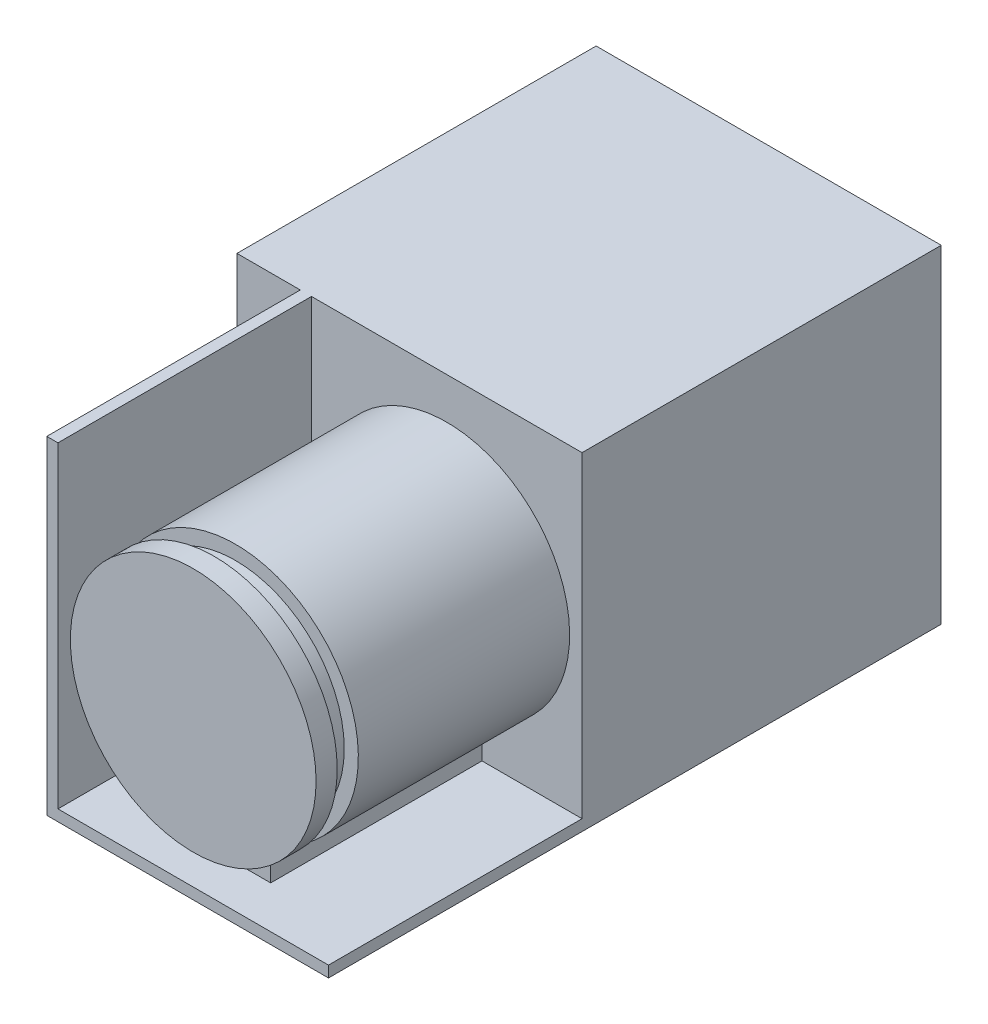
ISO-10303-21;
HEADER;
FILE_DESCRIPTION(('STEP AP214'),'2;1');
FILE_NAME('part.step','',(''),(''),'','','');
FILE_SCHEMA(('AUTOMOTIVE_DESIGN { 1 0 10303 214 1 1 1 1 }'));
ENDSEC;
DATA;
#1=APPLICATION_CONTEXT('core data for automotive mechanical design processes');
#2=APPLICATION_PROTOCOL_DEFINITION('international standard','automotive_design',2000,#1);
#3=PRODUCT_CONTEXT('',#1,'mechanical');
#4=PRODUCT('Part','Part','',(#3));
#5=PRODUCT_RELATED_PRODUCT_CATEGORY('part','',(#4));
#6=PRODUCT_DEFINITION_FORMATION('','',#4);
#7=PRODUCT_DEFINITION_CONTEXT('part definition',#1,'design');
#8=PRODUCT_DEFINITION('design','',#6,#7);
#9=PRODUCT_DEFINITION_SHAPE('','',#8);
#10=(LENGTH_UNIT() NAMED_UNIT(*) SI_UNIT(.MILLI.,.METRE.));
#11=(NAMED_UNIT(*) PLANE_ANGLE_UNIT() SI_UNIT($,.RADIAN.));
#12=(NAMED_UNIT(*) SI_UNIT($,.STERADIAN.) SOLID_ANGLE_UNIT());
#13=UNCERTAINTY_MEASURE_WITH_UNIT(LENGTH_MEASURE(1.E-05),#10,'distance_accuracy_value','');
#14=(GEOMETRIC_REPRESENTATION_CONTEXT(3) GLOBAL_UNCERTAINTY_ASSIGNED_CONTEXT((#13)) GLOBAL_UNIT_ASSIGNED_CONTEXT((#10,
#11,#12)) REPRESENTATION_CONTEXT('',''));
#15=CARTESIAN_POINT('',(0.,0.,0.));
#16=DIRECTION('',(0.,0.,1.));
#17=DIRECTION('',(1.,0.,0.));
#18=AXIS2_PLACEMENT_3D('',#15,#16,#17);
#19=CARTESIAN_POINT('',(0.,0.,87.));
#20=DIRECTION('',(0.,0.,1.));
#21=DIRECTION('',(1.,0.,0.));
#22=AXIS2_PLACEMENT_3D('',#19,#20,#21);
#23=PLANE('',#22);
#24=CARTESIAN_POINT('',(5.29375,0.,87.));
#25=DIRECTION('',(0.,0.,1.));
#26=DIRECTION('',(1.,0.,0.));
#27=AXIS2_PLACEMENT_3D('',#24,#25,#26);
#28=CIRCLE('',#27,17.4444161911484);
#29=CARTESIAN_POINT('',(22.7381661911484,0.,87.));
#30=VERTEX_POINT('',#29);
#31=EDGE_CURVE('E169',#30,#30,#28,.T.);
#32=ORIENTED_EDGE('',*,*,#31,.T.);
#33=EDGE_LOOP('',(#32));
#34=FACE_BOUND('',#33,.T.);
#35=ADVANCED_FACE('F41',(#34),#23,.T.);
#36=CARTESIAN_POINT('',(10.29375,-21.7125,139.445159076893));
#37=DIRECTION('',(-1.,0.,0.));
#38=DIRECTION('',(0.,0.,1.));
#39=AXIS2_PLACEMENT_3D('',#36,#37,#38);
#40=PLANE('',#39);
#41=DIRECTION('',(0.,-1.,0.));
#42=VECTOR('',#41,1.);
#43=CARTESIAN_POINT('',(10.29375,-21.7125,81.));
#44=LINE('',#43,#42);
#45=CARTESIAN_POINT('',(10.29375,-16.7125,81.));
#46=VERTEX_POINT('',#45);
#47=CARTESIAN_POINT('',(10.29375,-21.7125,81.));
#48=VERTEX_POINT('',#47);
#49=EDGE_CURVE('E140',#46,#48,#44,.T.);
#50=ORIENTED_EDGE('',*,*,#49,.T.);
#51=DIRECTION('',(0.,0.,-1.));
#52=VECTOR('',#51,1.);
#53=CARTESIAN_POINT('',(10.29375,-21.7125,139.445159076893));
#54=LINE('',#53,#52);
#55=CARTESIAN_POINT('',(10.29375,-21.7125,51.));
#56=VERTEX_POINT('',#55);
#57=EDGE_CURVE('E152',#48,#56,#54,.T.);
#58=ORIENTED_EDGE('',*,*,#57,.T.);
#59=DIRECTION('',(0.,1.,0.));
#60=VECTOR('',#59,1.);
#61=CARTESIAN_POINT('',(10.29375,-21.7125,51.));
#62=LINE('',#61,#60);
#63=CARTESIAN_POINT('',(10.29375,-16.7125,51.));
#64=VERTEX_POINT('',#63);
#65=EDGE_CURVE('E161',#56,#64,#62,.T.);
#66=ORIENTED_EDGE('',*,*,#65,.T.);
#67=DIRECTION('',(0.,0.,-1.));
#68=VECTOR('',#67,1.);
#69=CARTESIAN_POINT('',(10.29375,-16.7125,139.445159076893));
#70=LINE('',#69,#68);
#71=EDGE_CURVE('E154',#46,#64,#70,.T.);
#72=ORIENTED_EDGE('',*,*,#71,.F.);
#73=EDGE_LOOP('',(#50,#58,#66,#72));
#74=FACE_BOUND('',#73,.T.);
#75=ADVANCED_FACE('F150',(#74),#40,.F.);
#76=CARTESIAN_POINT('',(0.29375,-21.7125,139.445159076893));
#77=DIRECTION('',(1.,0.,0.));
#78=DIRECTION('',(0.,1.,0.));
#79=AXIS2_PLACEMENT_3D('',#76,#77,#78);
#80=PLANE('',#79);
#81=DIRECTION('',(0.,1.,0.));
#82=VECTOR('',#81,1.);
#83=CARTESIAN_POINT('',(0.293749999999999,-21.7125,81.));
#84=LINE('',#83,#82);
#85=CARTESIAN_POINT('',(0.293749999999999,-21.7125,81.));
#86=VERTEX_POINT('',#85);
#87=CARTESIAN_POINT('',(0.293749999999994,-16.7125,81.));
#88=VERTEX_POINT('',#87);
#89=EDGE_CURVE('E142',#86,#88,#84,.T.);
#90=ORIENTED_EDGE('',*,*,#89,.T.);
#91=DIRECTION('',(0.,0.,-1.));
#92=VECTOR('',#91,1.);
#93=CARTESIAN_POINT('',(0.293749999999999,-16.7125,139.445159076893));
#94=LINE('',#93,#92);
#95=CARTESIAN_POINT('',(0.293749999999999,-16.7125,51.));
#96=VERTEX_POINT('',#95);
#97=EDGE_CURVE('E172',#88,#96,#94,.T.);
#98=ORIENTED_EDGE('',*,*,#97,.T.);
#99=DIRECTION('',(0.,-1.,0.));
#100=VECTOR('',#99,1.);
#101=CARTESIAN_POINT('',(0.29375,-21.7125,51.));
#102=LINE('',#101,#100);
#103=CARTESIAN_POINT('',(0.29375,-21.7125,51.));
#104=VERTEX_POINT('',#103);
#105=EDGE_CURVE('E173',#96,#104,#102,.T.);
#106=ORIENTED_EDGE('',*,*,#105,.T.);
#107=DIRECTION('',(0.,0.,-1.));
#108=VECTOR('',#107,1.);
#109=CARTESIAN_POINT('',(0.29375,-21.7125,139.445159076893));
#110=LINE('',#109,#108);
#111=EDGE_CURVE('E162',#86,#104,#110,.T.);
#112=ORIENTED_EDGE('',*,*,#111,.F.);
#113=EDGE_LOOP('',(#90,#98,#106,#112));
#114=FACE_BOUND('',#113,.T.);
#115=ADVANCED_FACE('F289',(#114),#80,.F.);
#116=CARTESIAN_POINT('',(5.29375,0.,139.445159076893));
#117=DIRECTION('',(0.,0.,-1.));
#118=DIRECTION('',(-1.,0.,0.));
#119=AXIS2_PLACEMENT_3D('',#116,#117,#118);
#120=CYLINDRICAL_SURFACE('',#119,17.4444161911484);
#121=CARTESIAN_POINT('',(5.29375,0.,81.));
#122=DIRECTION('',(0.,0.,1.));
#123=DIRECTION('',(1.,0.,0.));
#124=AXIS2_PLACEMENT_3D('',#121,#122,#123);
#125=CIRCLE('',#124,17.4444161911484);
#126=EDGE_CURVE('E165',#46,#88,#125,.T.);
#127=ORIENTED_EDGE('',*,*,#126,.F.);
#128=ORIENTED_EDGE('',*,*,#71,.T.);
#129=CARTESIAN_POINT('',(5.29375,0.,51.));
#130=DIRECTION('',(0.,0.,1.));
#131=DIRECTION('',(1.,0.,0.));
#132=AXIS2_PLACEMENT_3D('',#129,#130,#131);
#133=CIRCLE('',#132,17.4444161911484);
#134=EDGE_CURVE('E171',#64,#96,#133,.T.);
#135=ORIENTED_EDGE('',*,*,#134,.T.);
#136=ORIENTED_EDGE('',*,*,#97,.F.);
#137=EDGE_LOOP('',(#127,#128,#135,#136));
#138=FACE_BOUND('',#137,.T.);
#139=ADVANCED_FACE('F279',(#138),#120,.T.);
#140=CARTESIAN_POINT('',(0.,0.,51.));
#141=DIRECTION('',(0.,0.,-1.));
#142=DIRECTION('',(-1.,0.,0.));
#143=AXIS2_PLACEMENT_3D('',#140,#141,#142);
#144=PLANE('',#143);
#145=ORIENTED_EDGE('',*,*,#65,.F.);
#146=DIRECTION('',(-1.,0.,0.));
#147=VECTOR('',#146,1.);
#148=CARTESIAN_POINT('',(24.5,-21.7125,51.));
#149=LINE('',#148,#147);
#150=CARTESIAN_POINT('',(24.5,-21.7125,51.));
#151=VERTEX_POINT('',#150);
#152=EDGE_CURVE('E160',#151,#56,#149,.T.);
#153=ORIENTED_EDGE('',*,*,#152,.F.);
#154=DIRECTION('',(0.,1.,0.));
#155=VECTOR('',#154,1.);
#156=CARTESIAN_POINT('',(24.5,23.3,51.));
#157=LINE('',#156,#155);
#158=CARTESIAN_POINT('',(24.5,23.3,51.));
#159=VERTEX_POINT('',#158);
#160=EDGE_CURVE('E214',#151,#159,#157,.T.);
#161=ORIENTED_EDGE('',*,*,#160,.T.);
#162=DIRECTION('',(-1.,0.,0.));
#163=VECTOR('',#162,1.);
#164=CARTESIAN_POINT('',(24.5,23.3,51.));
#165=LINE('',#164,#163);
#166=CARTESIAN_POINT('',(-13.9125,23.3,51.));
#167=VERTEX_POINT('',#166);
#168=EDGE_CURVE('E64',#159,#167,#165,.T.);
#169=ORIENTED_EDGE('',*,*,#168,.T.);
#170=DIRECTION('',(0.,1.,0.));
#171=VECTOR('',#170,1.);
#172=CARTESIAN_POINT('',(-13.9125,-21.7125,51.));
#173=LINE('',#172,#171);
#174=CARTESIAN_POINT('',(-13.9125,-21.7125,51.));
#175=VERTEX_POINT('',#174);
#176=EDGE_CURVE('E190',#175,#167,#173,.T.);
#177=ORIENTED_EDGE('',*,*,#176,.F.);
#178=EDGE_CURVE('E191',#104,#175,#149,.T.);
#179=ORIENTED_EDGE('',*,*,#178,.F.);
#180=ORIENTED_EDGE('',*,*,#105,.F.);
#181=ORIENTED_EDGE('',*,*,#134,.F.);
#182=EDGE_LOOP('',(#145,#153,#161,#169,#177,#179,#180,#181));
#183=FACE_BOUND('',#182,.T.);
#184=ADVANCED_FACE('F263',(#183),#144,.F.);
#185=CARTESIAN_POINT('',(24.5,-21.7125,87.));
#186=DIRECTION('',(0.,-1.,0.));
#187=DIRECTION('',(1.,0.,0.));
#188=AXIS2_PLACEMENT_3D('',#185,#186,#187);
#189=PLANE('',#188);
#190=DIRECTION('',(0.,0.,-1.));
#191=VECTOR('',#190,1.);
#192=CARTESIAN_POINT('',(-13.9125,-21.7125,87.));
#193=LINE('',#192,#191);
#194=CARTESIAN_POINT('',(-13.9125,-21.7125,87.));
#195=VERTEX_POINT('',#194);
#196=EDGE_CURVE('E202',#195,#175,#193,.T.);
#197=ORIENTED_EDGE('',*,*,#196,.F.);
#198=DIRECTION('',(-1.,0.,0.));
#199=VECTOR('',#198,1.);
#200=CARTESIAN_POINT('',(24.5,-21.7125,87.));
#201=LINE('',#200,#199);
#202=CARTESIAN_POINT('',(24.5,-21.7125,87.));
#203=VERTEX_POINT('',#202);
#204=EDGE_CURVE('E180',#203,#195,#201,.T.);
#205=ORIENTED_EDGE('',*,*,#204,.F.);
#206=DIRECTION('',(0.,0.,-1.));
#207=VECTOR('',#206,1.);
#208=CARTESIAN_POINT('',(24.5,-21.7125,87.));
#209=LINE('',#208,#207);
#210=EDGE_CURVE('E205',#203,#151,#209,.T.);
#211=ORIENTED_EDGE('',*,*,#210,.T.);
#212=ORIENTED_EDGE('',*,*,#152,.T.);
#213=ORIENTED_EDGE('',*,*,#57,.F.);
#214=DIRECTION('',(-1.,0.,0.));
#215=VECTOR('',#214,1.);
#216=CARTESIAN_POINT('',(0.293749999999999,-21.7125,81.));
#217=LINE('',#216,#215);
#218=EDGE_CURVE('E136',#48,#86,#217,.T.);
#219=ORIENTED_EDGE('',*,*,#218,.T.);
#220=ORIENTED_EDGE('',*,*,#111,.T.);
#221=ORIENTED_EDGE('',*,*,#178,.T.);
#222=EDGE_LOOP('',(#197,#205,#211,#212,#213,#219,#220,#221));
#223=FACE_BOUND('',#222,.T.);
#224=ADVANCED_FACE('F158',(#223),#189,.F.);
#225=DIRECTION('',(0.,-1.,0.));
#226=VECTOR('',#225,1.);
#227=CARTESIAN_POINT('',(-15.5,23.3,51.));
#228=LINE('',#227,#226);
#229=CARTESIAN_POINT('',(-15.5,23.3,51.));
#230=VERTEX_POINT('',#229);
#231=CARTESIAN_POINT('',(-15.5,-23.3,51.));
#232=VERTEX_POINT('',#231);
#233=EDGE_CURVE('E56',#230,#232,#228,.T.);
#234=ORIENTED_EDGE('',*,*,#233,.F.);
#235=CARTESIAN_POINT('',(-24.5,23.3,51.));
#236=VERTEX_POINT('',#235);
#237=EDGE_CURVE('E216',#230,#236,#165,.T.);
#238=ORIENTED_EDGE('',*,*,#237,.T.);
#239=DIRECTION('',(0.,-1.,0.));
#240=VECTOR('',#239,1.);
#241=CARTESIAN_POINT('',(-24.5,23.3,51.));
#242=LINE('',#241,#240);
#243=CARTESIAN_POINT('',(-24.5,-23.3,51.));
#244=VERTEX_POINT('',#243);
#245=EDGE_CURVE('E208',#236,#244,#242,.T.);
#246=ORIENTED_EDGE('',*,*,#245,.T.);
#247=DIRECTION('',(1.,0.,0.));
#248=VECTOR('',#247,1.);
#249=CARTESIAN_POINT('',(24.5,-23.3,51.));
#250=LINE('',#249,#248);
#251=EDGE_CURVE('E211',#244,#232,#250,.T.);
#252=ORIENTED_EDGE('',*,*,#251,.T.);
#253=EDGE_LOOP('',(#234,#238,#246,#252));
#254=FACE_BOUND('',#253,.T.);
#255=ADVANCED_FACE('F249',(#254),#144,.F.);
#256=CARTESIAN_POINT('',(-24.5,23.3,51.));
#257=DIRECTION('',(1.,0.,0.));
#258=DIRECTION('',(0.,1.,0.));
#259=AXIS2_PLACEMENT_3D('',#256,#257,#258);
#260=PLANE('',#259);
#261=DIRECTION('',(0.,-1.,0.));
#262=VECTOR('',#261,1.);
#263=CARTESIAN_POINT('',(-24.5,23.3,0.));
#264=LINE('',#263,#262);
#265=CARTESIAN_POINT('',(-24.5,23.3,0.));
#266=VERTEX_POINT('',#265);
#267=CARTESIAN_POINT('',(-24.5,-23.3,0.));
#268=VERTEX_POINT('',#267);
#269=EDGE_CURVE('E207',#266,#268,#264,.T.);
#270=ORIENTED_EDGE('',*,*,#269,.T.);
#271=DIRECTION('',(0.,0.,-1.));
#272=VECTOR('',#271,1.);
#273=CARTESIAN_POINT('',(-24.5,-23.3,51.));
#274=LINE('',#273,#272);
#275=EDGE_CURVE('E11',#244,#268,#274,.T.);
#276=ORIENTED_EDGE('',*,*,#275,.F.);
#277=ORIENTED_EDGE('',*,*,#245,.F.);
#278=DIRECTION('',(0.,0.,-1.));
#279=VECTOR('',#278,1.);
#280=CARTESIAN_POINT('',(-24.5,23.3,51.));
#281=LINE('',#280,#279);
#282=EDGE_CURVE('E218',#236,#266,#281,.T.);
#283=ORIENTED_EDGE('',*,*,#282,.T.);
#284=EDGE_LOOP('',(#270,#276,#277,#283));
#285=FACE_BOUND('',#284,.T.);
#286=ADVANCED_FACE('F43',(#285),#260,.F.);
#287=CARTESIAN_POINT('',(24.5,-23.3,51.));
#288=DIRECTION('',(0.,1.,0.));
#289=DIRECTION('',(-1.,0.,0.));
#290=AXIS2_PLACEMENT_3D('',#287,#288,#289);
#291=PLANE('',#290);
#292=DIRECTION('',(1.,0.,0.));
#293=VECTOR('',#292,1.);
#294=CARTESIAN_POINT('',(24.5,-23.3,0.));
#295=LINE('',#294,#293);
#296=CARTESIAN_POINT('',(24.5,-23.3,0.));
#297=VERTEX_POINT('',#296);
#298=EDGE_CURVE('E221',#268,#297,#295,.T.);
#299=ORIENTED_EDGE('',*,*,#298,.T.);
#300=DIRECTION('',(0.,0.,-1.));
#301=VECTOR('',#300,1.);
#302=CARTESIAN_POINT('',(24.5,-23.3,51.));
#303=LINE('',#302,#301);
#304=CARTESIAN_POINT('',(24.5,-23.3,87.));
#305=VERTEX_POINT('',#304);
#306=EDGE_CURVE('E49',#305,#297,#303,.T.);
#307=ORIENTED_EDGE('',*,*,#306,.F.);
#308=DIRECTION('',(1.,0.,0.));
#309=VECTOR('',#308,1.);
#310=CARTESIAN_POINT('',(-15.5,-23.3,87.));
#311=LINE('',#310,#309);
#312=CARTESIAN_POINT('',(-15.5,-23.3,87.));
#313=VERTEX_POINT('',#312);
#314=EDGE_CURVE('E175',#313,#305,#311,.T.);
#315=ORIENTED_EDGE('',*,*,#314,.F.);
#316=DIRECTION('',(0.,0.,-1.));
#317=VECTOR('',#316,1.);
#318=CARTESIAN_POINT('',(-15.5,-23.3,87.));
#319=LINE('',#318,#317);
#320=EDGE_CURVE('E188',#313,#232,#319,.T.);
#321=ORIENTED_EDGE('',*,*,#320,.T.);
#322=ORIENTED_EDGE('',*,*,#251,.F.);
#323=ORIENTED_EDGE('',*,*,#275,.T.);
#324=EDGE_LOOP('',(#299,#307,#315,#321,#322,#323));
#325=FACE_BOUND('',#324,.T.);
#326=ADVANCED_FACE('F327',(#325),#291,.F.);
#327=CARTESIAN_POINT('',(24.5,23.3,51.));
#328=DIRECTION('',(-1.,0.,0.));
#329=DIRECTION('',(0.,-1.,0.));
#330=AXIS2_PLACEMENT_3D('',#327,#328,#329);
#331=PLANE('',#330);
#332=DIRECTION('',(0.,1.,0.));
#333=VECTOR('',#332,1.);
#334=CARTESIAN_POINT('',(24.5,23.3,0.));
#335=LINE('',#334,#333);
#336=CARTESIAN_POINT('',(24.5,23.3,0.));
#337=VERTEX_POINT('',#336);
#338=EDGE_CURVE('E223',#297,#337,#335,.T.);
#339=ORIENTED_EDGE('',*,*,#338,.T.);
#340=DIRECTION('',(0.,0.,-1.));
#341=VECTOR('',#340,1.);
#342=CARTESIAN_POINT('',(24.5,23.3,51.));
#343=LINE('',#342,#341);
#344=EDGE_CURVE('E228',#159,#337,#343,.T.);
#345=ORIENTED_EDGE('',*,*,#344,.F.);
#346=ORIENTED_EDGE('',*,*,#160,.F.);
#347=ORIENTED_EDGE('',*,*,#210,.F.);
#348=DIRECTION('',(0.,1.,0.));
#349=VECTOR('',#348,1.);
#350=CARTESIAN_POINT('',(24.5,-23.3,87.));
#351=LINE('',#350,#349);
#352=EDGE_CURVE('E178',#305,#203,#351,.T.);
#353=ORIENTED_EDGE('',*,*,#352,.F.);
#354=ORIENTED_EDGE('',*,*,#306,.T.);
#355=EDGE_LOOP('',(#339,#345,#346,#347,#353,#354));
#356=FACE_BOUND('',#355,.T.);
#357=ADVANCED_FACE('F234',(#356),#331,.F.);
#358=CARTESIAN_POINT('',(24.5,23.3,51.));
#359=DIRECTION('',(0.,-1.,0.));
#360=DIRECTION('',(1.,0.,0.));
#361=AXIS2_PLACEMENT_3D('',#358,#359,#360);
#362=PLANE('',#361);
#363=DIRECTION('',(-1.,0.,0.));
#364=VECTOR('',#363,1.);
#365=CARTESIAN_POINT('',(24.5,23.3,0.));
#366=LINE('',#365,#364);
#367=EDGE_CURVE('E212',#337,#266,#366,.T.);
#368=ORIENTED_EDGE('',*,*,#367,.T.);
#369=ORIENTED_EDGE('',*,*,#282,.F.);
#370=ORIENTED_EDGE('',*,*,#237,.F.);
#371=DIRECTION('',(0.,0.,-1.));
#372=VECTOR('',#371,1.);
#373=CARTESIAN_POINT('',(-15.5,23.3,87.));
#374=LINE('',#373,#372);
#375=CARTESIAN_POINT('',(-15.5,23.3,87.));
#376=VERTEX_POINT('',#375);
#377=EDGE_CURVE('E196',#376,#230,#374,.T.);
#378=ORIENTED_EDGE('',*,*,#377,.F.);
#379=DIRECTION('',(-1.,0.,0.));
#380=VECTOR('',#379,1.);
#381=CARTESIAN_POINT('',(-13.9125,23.3,87.));
#382=LINE('',#381,#380);
#383=CARTESIAN_POINT('',(-13.9125,23.3,87.));
#384=VERTEX_POINT('',#383);
#385=EDGE_CURVE('E184',#384,#376,#382,.T.);
#386=ORIENTED_EDGE('',*,*,#385,.F.);
#387=DIRECTION('',(0.,0.,-1.));
#388=VECTOR('',#387,1.);
#389=CARTESIAN_POINT('',(-13.9125,23.3,87.));
#390=LINE('',#389,#388);
#391=EDGE_CURVE('E199',#384,#167,#390,.T.);
#392=ORIENTED_EDGE('',*,*,#391,.T.);
#393=ORIENTED_EDGE('',*,*,#168,.F.);
#394=ORIENTED_EDGE('',*,*,#344,.T.);
#395=EDGE_LOOP('',(#368,#369,#370,#378,#386,#392,#393,#394));
#396=FACE_BOUND('',#395,.T.);
#397=ADVANCED_FACE('F245',(#396),#362,.F.);
#398=CARTESIAN_POINT('',(0.,0.,0.));
#399=DIRECTION('',(0.,0.,-1.));
#400=DIRECTION('',(-1.,0.,0.));
#401=AXIS2_PLACEMENT_3D('',#398,#399,#400);
#402=PLANE('',#401);
#403=ORIENTED_EDGE('',*,*,#269,.F.);
#404=ORIENTED_EDGE('',*,*,#367,.F.);
#405=ORIENTED_EDGE('',*,*,#338,.F.);
#406=ORIENTED_EDGE('',*,*,#298,.F.);
#407=EDGE_LOOP('',(#403,#404,#405,#406));
#408=FACE_BOUND('',#407,.T.);
#409=ADVANCED_FACE('F242',(#408),#402,.T.);
#410=CARTESIAN_POINT('',(-13.9125,-21.7125,87.));
#411=DIRECTION('',(-1.,0.,0.));
#412=DIRECTION('',(0.,0.,1.));
#413=AXIS2_PLACEMENT_3D('',#410,#411,#412);
#414=PLANE('',#413);
#415=ORIENTED_EDGE('',*,*,#176,.T.);
#416=ORIENTED_EDGE('',*,*,#391,.F.);
#417=DIRECTION('',(0.,1.,0.));
#418=VECTOR('',#417,1.);
#419=CARTESIAN_POINT('',(-13.9125,-21.7125,87.));
#420=LINE('',#419,#418);
#421=EDGE_CURVE('E182',#195,#384,#420,.T.);
#422=ORIENTED_EDGE('',*,*,#421,.F.);
#423=ORIENTED_EDGE('',*,*,#196,.T.);
#424=EDGE_LOOP('',(#415,#416,#422,#423));
#425=FACE_BOUND('',#424,.T.);
#426=ADVANCED_FACE('F261',(#425),#414,.F.);
#427=CARTESIAN_POINT('',(-15.5,23.3,87.));
#428=DIRECTION('',(1.,0.,0.));
#429=DIRECTION('',(0.,1.,0.));
#430=AXIS2_PLACEMENT_3D('',#427,#428,#429);
#431=PLANE('',#430);
#432=ORIENTED_EDGE('',*,*,#233,.T.);
#433=ORIENTED_EDGE('',*,*,#320,.F.);
#434=DIRECTION('',(0.,-1.,0.));
#435=VECTOR('',#434,1.);
#436=CARTESIAN_POINT('',(-15.5,23.3,87.));
#437=LINE('',#436,#435);
#438=EDGE_CURVE('E186',#376,#313,#437,.T.);
#439=ORIENTED_EDGE('',*,*,#438,.F.);
#440=ORIENTED_EDGE('',*,*,#377,.T.);
#441=EDGE_LOOP('',(#432,#433,#439,#440));
#442=FACE_BOUND('',#441,.T.);
#443=ADVANCED_FACE('F254',(#442),#431,.F.);
#444=ORIENTED_EDGE('',*,*,#204,.T.);
#445=ORIENTED_EDGE('',*,*,#421,.T.);
#446=ORIENTED_EDGE('',*,*,#385,.T.);
#447=ORIENTED_EDGE('',*,*,#438,.T.);
#448=ORIENTED_EDGE('',*,*,#314,.T.);
#449=ORIENTED_EDGE('',*,*,#352,.T.);
#450=EDGE_LOOP('',(#444,#445,#446,#447,#448,#449));
#451=FACE_BOUND('',#450,.T.);
#452=ADVANCED_FACE('F257',(#451),#23,.T.);
#453=CARTESIAN_POINT('',(5.29375,0.,84.));
#454=DIRECTION('',(0.,0.,1.));
#455=DIRECTION('',(1.,0.,0.));
#456=AXIS2_PLACEMENT_3D('',#453,#454,#455);
#457=CIRCLE('',#456,17.4444161911484);
#458=CARTESIAN_POINT('',(22.7381661911484,0.,84.));
#459=VERTEX_POINT('',#458);
#460=EDGE_CURVE('E274',#459,#459,#457,.T.);
#461=ORIENTED_EDGE('',*,*,#460,.T.);
#462=EDGE_LOOP('',(#461));
#463=FACE_BOUND('',#462,.T.);
#464=ORIENTED_EDGE('',*,*,#31,.F.);
#465=EDGE_LOOP('',(#464));
#466=FACE_BOUND('',#465,.T.);
#467=ADVANCED_FACE('F297',(#463,#466),#120,.T.);
#468=CARTESIAN_POINT('',(5.29375,0.,81.));
#469=DIRECTION('',(0.,0.,1.));
#470=DIRECTION('',(1.,0.,0.));
#471=AXIS2_PLACEMENT_3D('',#468,#469,#470);
#472=PLANE('',#471);
#473=CARTESIAN_POINT('',(5.29375,0.,81.));
#474=DIRECTION('',(0.,0.,1.));
#475=DIRECTION('',(1.,0.,0.));
#476=AXIS2_PLACEMENT_3D('',#473,#474,#475);
#477=CIRCLE('',#476,15.4444161911484);
#478=CARTESIAN_POINT('',(20.7381661911484,0.,81.));
#479=VERTEX_POINT('',#478);
#480=EDGE_CURVE('E283',#479,#479,#477,.T.);
#481=ORIENTED_EDGE('',*,*,#480,.F.);
#482=EDGE_LOOP('',(#481));
#483=FACE_BOUND('',#482,.T.);
#484=ORIENTED_EDGE('',*,*,#126,.T.);
#485=ORIENTED_EDGE('',*,*,#89,.F.);
#486=ORIENTED_EDGE('',*,*,#218,.F.);
#487=ORIENTED_EDGE('',*,*,#49,.F.);
#488=EDGE_LOOP('',(#484,#485,#486,#487));
#489=FACE_BOUND('',#488,.T.);
#490=ADVANCED_FACE('F139',(#483,#489),#472,.T.);
#491=CARTESIAN_POINT('',(5.29375,0.,84.));
#492=DIRECTION('',(0.,0.,1.));
#493=DIRECTION('',(1.,0.,0.));
#494=AXIS2_PLACEMENT_3D('',#491,#492,#493);
#495=PLANE('',#494);
#496=CARTESIAN_POINT('',(5.29375,0.,84.));
#497=DIRECTION('',(0.,0.,1.));
#498=DIRECTION('',(1.,0.,0.));
#499=AXIS2_PLACEMENT_3D('',#496,#497,#498);
#500=CIRCLE('',#499,15.4444161911484);
#501=CARTESIAN_POINT('',(20.7381661911484,0.,84.));
#502=VERTEX_POINT('',#501);
#503=EDGE_CURVE('E146',#502,#502,#500,.T.);
#504=ORIENTED_EDGE('',*,*,#503,.T.);
#505=EDGE_LOOP('',(#504));
#506=FACE_BOUND('',#505,.T.);
#507=ORIENTED_EDGE('',*,*,#460,.F.);
#508=EDGE_LOOP('',(#507));
#509=FACE_BOUND('',#508,.T.);
#510=ADVANCED_FACE('F397',(#506,#509),#495,.F.);
#511=CARTESIAN_POINT('',(5.29375,0.,81.));
#512=DIRECTION('',(0.,0.,1.));
#513=DIRECTION('',(1.,0.,0.));
#514=AXIS2_PLACEMENT_3D('',#511,#512,#513);
#515=CYLINDRICAL_SURFACE('',#514,15.4444161911484);
#516=ORIENTED_EDGE('',*,*,#480,.T.);
#517=EDGE_LOOP('',(#516));
#518=FACE_BOUND('',#517,.T.);
#519=ORIENTED_EDGE('',*,*,#503,.F.);
#520=EDGE_LOOP('',(#519));
#521=FACE_BOUND('',#520,.T.);
#522=ADVANCED_FACE('F407',(#518,#521),#515,.T.);
#523=CLOSED_SHELL('',(#35,#75,#115,#139,#184,#224,#255,#286,#326,#357,#397,#409,#426,#443,#452,
#467,#490,#510,#522));
#524=MANIFOLD_SOLID_BREP('B2',#523);
#525=ADVANCED_BREP_SHAPE_REPRESENTATION('',(#18,#524),#14);
#526=SHAPE_DEFINITION_REPRESENTATION(#9,#525);
ENDSEC;
END-ISO-10303-21;
